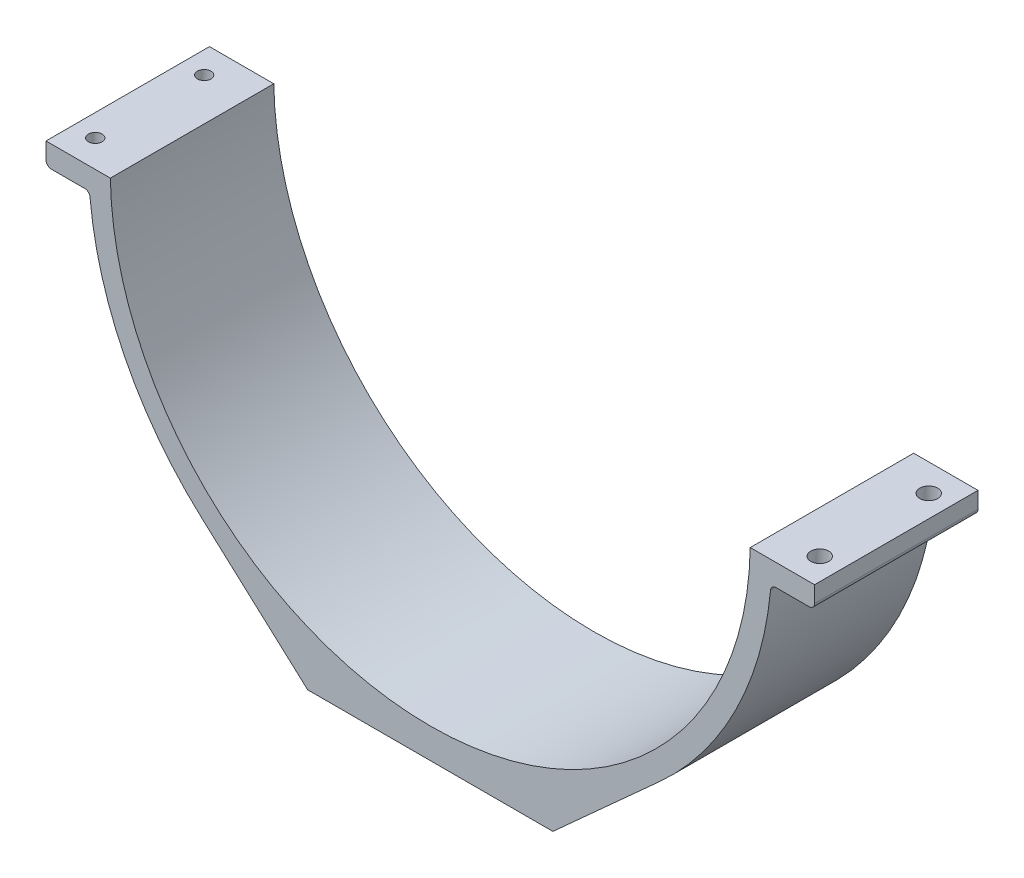
ISO-10303-21;
HEADER;
FILE_DESCRIPTION(('STEP AP214'),'2;1');
FILE_NAME('part.step','',(''),(''),'','','');
FILE_SCHEMA(('AUTOMOTIVE_DESIGN { 1 0 10303 214 1 1 1 1 }'));
ENDSEC;
DATA;
#1=APPLICATION_CONTEXT('core data for automotive mechanical design processes');
#2=APPLICATION_PROTOCOL_DEFINITION('international standard','automotive_design',2000,#1);
#3=PRODUCT_CONTEXT('',#1,'mechanical');
#4=PRODUCT('Part','Part','',(#3));
#5=PRODUCT_RELATED_PRODUCT_CATEGORY('part','',(#4));
#6=PRODUCT_DEFINITION_FORMATION('','',#4);
#7=PRODUCT_DEFINITION_CONTEXT('part definition',#1,'design');
#8=PRODUCT_DEFINITION('design','',#6,#7);
#9=PRODUCT_DEFINITION_SHAPE('','',#8);
#10=(LENGTH_UNIT() NAMED_UNIT(*) SI_UNIT(.MILLI.,.METRE.));
#11=(NAMED_UNIT(*) PLANE_ANGLE_UNIT() SI_UNIT($,.RADIAN.));
#12=(NAMED_UNIT(*) SI_UNIT($,.STERADIAN.) SOLID_ANGLE_UNIT());
#13=UNCERTAINTY_MEASURE_WITH_UNIT(LENGTH_MEASURE(1.E-05),#10,'distance_accuracy_value','');
#14=(GEOMETRIC_REPRESENTATION_CONTEXT(3) GLOBAL_UNCERTAINTY_ASSIGNED_CONTEXT((#13)) GLOBAL_UNIT_ASSIGNED_CONTEXT((#10,
#11,#12)) REPRESENTATION_CONTEXT('',''));
#15=CARTESIAN_POINT('',(0.,0.,0.));
#16=DIRECTION('',(0.,0.,1.));
#17=DIRECTION('',(1.,0.,0.));
#18=AXIS2_PLACEMENT_3D('',#15,#16,#17);
#19=CARTESIAN_POINT('',(-70.5404477118608,-1.,30.));
#20=DIRECTION('',(1.,0.,0.));
#21=DIRECTION('',(0.,1.,0.));
#22=AXIS2_PLACEMENT_3D('',#19,#20,#21);
#23=PLANE('',#22);
#24=DIRECTION('',(0.,-1.,0.));
#25=VECTOR('',#24,1.);
#26=CARTESIAN_POINT('',(-70.5404477118608,-1.,0.));
#27=LINE('',#26,#25);
#28=CARTESIAN_POINT('',(-70.5404477118608,-1.,0.));
#29=VERTEX_POINT('',#28);
#30=CARTESIAN_POINT('',(-70.5404477118608,-4.,0.));
#31=VERTEX_POINT('',#30);
#32=EDGE_CURVE('E197',#29,#31,#27,.T.);
#33=ORIENTED_EDGE('',*,*,#32,.T.);
#34=DIRECTION('',(0.,0.,-1.));
#35=VECTOR('',#34,1.);
#36=CARTESIAN_POINT('',(-70.5404477118608,-4.,30.));
#37=LINE('',#36,#35);
#38=CARTESIAN_POINT('',(-70.5404477118608,-4.,30.));
#39=VERTEX_POINT('',#38);
#40=EDGE_CURVE('E11',#39,#31,#37,.T.);
#41=ORIENTED_EDGE('',*,*,#40,.F.);
#42=DIRECTION('',(0.,-1.,0.));
#43=VECTOR('',#42,1.);
#44=CARTESIAN_POINT('',(-70.5404477118608,-1.,30.));
#45=LINE('',#44,#43);
#46=CARTESIAN_POINT('',(-70.5404477118608,-1.,30.));
#47=VERTEX_POINT('',#46);
#48=EDGE_CURVE('E243',#47,#39,#45,.T.);
#49=ORIENTED_EDGE('',*,*,#48,.F.);
#50=DIRECTION('',(0.,0.,-1.));
#51=VECTOR('',#50,1.);
#52=CARTESIAN_POINT('',(-70.5404477118608,-1.,30.));
#53=LINE('',#52,#51);
#54=EDGE_CURVE('E193',#47,#29,#53,.T.);
#55=ORIENTED_EDGE('',*,*,#54,.T.);
#56=EDGE_LOOP('',(#33,#41,#49,#55));
#57=FACE_BOUND('',#56,.T.);
#58=ADVANCED_FACE('F43',(#57),#23,.F.);
#59=CARTESIAN_POINT('',(-69.5404477118608,-4.,30.));
#60=DIRECTION('',(0.,0.,-1.));
#61=DIRECTION('',(-1.,0.,0.));
#62=AXIS2_PLACEMENT_3D('',#59,#60,#61);
#63=CYLINDRICAL_SURFACE('',#62,0.999999999999994);
#64=CARTESIAN_POINT('',(-69.5404477118608,-4.,0.));
#65=DIRECTION('',(0.,0.,1.));
#66=DIRECTION('',(1.,0.,0.));
#67=AXIS2_PLACEMENT_3D('',#64,#65,#66);
#68=CIRCLE('',#67,0.999999999999994);
#69=CARTESIAN_POINT('',(-69.5404477118608,-5.,0.));
#70=VERTEX_POINT('',#69);
#71=EDGE_CURVE('E201',#31,#70,#68,.T.);
#72=ORIENTED_EDGE('',*,*,#71,.T.);
#73=DIRECTION('',(0.,0.,-1.));
#74=VECTOR('',#73,1.);
#75=CARTESIAN_POINT('',(-69.5404477118608,-5.,30.));
#76=LINE('',#75,#74);
#77=CARTESIAN_POINT('',(-69.5404477118608,-5.,30.));
#78=VERTEX_POINT('',#77);
#79=EDGE_CURVE('E52',#78,#70,#76,.T.);
#80=ORIENTED_EDGE('',*,*,#79,.F.);
#81=CARTESIAN_POINT('',(-69.5404477118608,-4.,30.));
#82=DIRECTION('',(0.,0.,1.));
#83=DIRECTION('',(1.,0.,0.));
#84=AXIS2_PLACEMENT_3D('',#81,#82,#83);
#85=CIRCLE('',#84,0.999999999999994);
#86=EDGE_CURVE('E128',#39,#78,#85,.T.);
#87=ORIENTED_EDGE('',*,*,#86,.F.);
#88=ORIENTED_EDGE('',*,*,#40,.T.);
#89=EDGE_LOOP('',(#72,#80,#87,#88));
#90=FACE_BOUND('',#89,.T.);
#91=ADVANCED_FACE('F413',(#90),#63,.T.);
#92=CARTESIAN_POINT('',(-69.5404477118608,-5.,30.));
#93=DIRECTION('',(0.,1.,0.));
#94=DIRECTION('',(-1.,0.,0.));
#95=AXIS2_PLACEMENT_3D('',#92,#93,#94);
#96=PLANE('',#95);
#97=CARTESIAN_POINT('',(-66.4987110559215,-4.99999999999999,5.));
#98=DIRECTION('',(0.,-1.,0.));
#99=DIRECTION('',(0.,0.,-1.));
#100=AXIS2_PLACEMENT_3D('',#97,#98,#99);
#101=CIRCLE('',#100,1.24999999999999);
#102=CARTESIAN_POINT('',(-66.4987110559215,-4.99999999999999,3.75000000000001));
#103=VERTEX_POINT('',#102);
#104=EDGE_CURVE('E393',#103,#103,#101,.T.);
#105=ORIENTED_EDGE('',*,*,#104,.F.);
#106=EDGE_LOOP('',(#105));
#107=FACE_BOUND('',#106,.T.);
#108=CARTESIAN_POINT('',(-66.4987110559215,-4.99999999999999,25.));
#109=DIRECTION('',(0.,-1.,0.));
#110=DIRECTION('',(0.,0.,-1.));
#111=AXIS2_PLACEMENT_3D('',#108,#109,#110);
#112=CIRCLE('',#111,1.24999999999999);
#113=CARTESIAN_POINT('',(-66.4987110559215,-4.99999999999999,23.75));
#114=VERTEX_POINT('',#113);
#115=EDGE_CURVE('E401',#114,#114,#112,.T.);
#116=ORIENTED_EDGE('',*,*,#115,.F.);
#117=EDGE_LOOP('',(#116));
#118=FACE_BOUND('',#117,.T.);
#119=DIRECTION('',(1.,0.,0.));
#120=VECTOR('',#119,1.);
#121=CARTESIAN_POINT('',(-69.5404477118608,-5.,0.));
#122=LINE('',#121,#120);
#123=CARTESIAN_POINT('',(-63.4569743999822,-4.99999999999999,0.));
#124=VERTEX_POINT('',#123);
#125=EDGE_CURVE('E205',#70,#124,#122,.T.);
#126=ORIENTED_EDGE('',*,*,#125,.T.);
#127=DIRECTION('',(0.,0.,-1.));
#128=VECTOR('',#127,1.);
#129=CARTESIAN_POINT('',(-63.4569743999822,-4.99999999999999,30.));
#130=LINE('',#129,#128);
#131=CARTESIAN_POINT('',(-63.4569743999822,-4.99999999999999,30.));
#132=VERTEX_POINT('',#131);
#133=EDGE_CURVE('E285',#132,#124,#130,.T.);
#134=ORIENTED_EDGE('',*,*,#133,.F.);
#135=DIRECTION('',(1.,0.,0.));
#136=VECTOR('',#135,1.);
#137=CARTESIAN_POINT('',(-69.5404477118608,-5.,30.));
#138=LINE('',#137,#136);
#139=EDGE_CURVE('E295',#78,#132,#138,.T.);
#140=ORIENTED_EDGE('',*,*,#139,.F.);
#141=ORIENTED_EDGE('',*,*,#79,.T.);
#142=EDGE_LOOP('',(#126,#134,#140,#141));
#143=FACE_BOUND('',#142,.T.);
#144=ADVANCED_FACE('F293',(#107,#118,#143),#96,.F.);
#145=CARTESIAN_POINT('',(-63.4569743999822,-6.,30.));
#146=DIRECTION('',(0.,0.,-1.));
#147=DIRECTION('',(-1.,0.,0.));
#148=AXIS2_PLACEMENT_3D('',#145,#146,#147);
#149=CYLINDRICAL_SURFACE('',#148,1.00000000000001);
#150=CARTESIAN_POINT('',(-63.4569743999822,-6.,0.));
#151=DIRECTION('',(0.,0.,-1.));
#152=DIRECTION('',(1.,0.,0.));
#153=AXIS2_PLACEMENT_3D('',#150,#151,#152);
#154=CIRCLE('',#153,1.00000000000001);
#155=CARTESIAN_POINT('',(-62.4614147137572,-5.90586758707246,0.));
#156=VERTEX_POINT('',#155);
#157=EDGE_CURVE('E208',#124,#156,#154,.T.);
#158=ORIENTED_EDGE('',*,*,#157,.T.);
#159=DIRECTION('',(0.,0.,-1.));
#160=VECTOR('',#159,1.);
#161=CARTESIAN_POINT('',(-62.4614147137572,-5.90586758707246,30.));
#162=LINE('',#161,#160);
#163=CARTESIAN_POINT('',(-62.4614147137572,-5.90586758707246,30.));
#164=VERTEX_POINT('',#163);
#165=EDGE_CURVE('E281',#164,#156,#162,.T.);
#166=ORIENTED_EDGE('',*,*,#165,.F.);
#167=CARTESIAN_POINT('',(-63.4569743999822,-6.,30.));
#168=DIRECTION('',(0.,0.,-1.));
#169=DIRECTION('',(1.,0.,0.));
#170=AXIS2_PLACEMENT_3D('',#167,#168,#169);
#171=CIRCLE('',#170,1.00000000000001);
#172=EDGE_CURVE('E314',#132,#164,#171,.T.);
#173=ORIENTED_EDGE('',*,*,#172,.F.);
#174=ORIENTED_EDGE('',*,*,#133,.T.);
#175=EDGE_LOOP('',(#158,#166,#173,#174));
#176=FACE_BOUND('',#175,.T.);
#177=ADVANCED_FACE('F304',(#176),#149,.F.);
#178=CARTESIAN_POINT('',(0.,0.,30.));
#179=DIRECTION('',(0.,0.,-1.));
#180=DIRECTION('',(-1.,0.,0.));
#181=AXIS2_PLACEMENT_3D('',#178,#179,#180);
#182=CYLINDRICAL_SURFACE('',#181,62.74);
#183=CARTESIAN_POINT('',(0.,0.,0.));
#184=DIRECTION('',(0.,0.,1.));
#185=DIRECTION('',(1.,0.,0.));
#186=AXIS2_PLACEMENT_3D('',#183,#184,#185);
#187=CIRCLE('',#186,62.74);
#188=CARTESIAN_POINT('',(-42.0786666547349,-46.5370112121491,0.));
#189=VERTEX_POINT('',#188);
#190=EDGE_CURVE('E211',#156,#189,#187,.T.);
#191=ORIENTED_EDGE('',*,*,#190,.T.);
#192=DIRECTION('',(0.,0.,-1.));
#193=VECTOR('',#192,1.);
#194=CARTESIAN_POINT('',(-42.0786666547349,-46.5370112121491,30.));
#195=LINE('',#194,#193);
#196=CARTESIAN_POINT('',(-42.0786666547349,-46.5370112121491,30.));
#197=VERTEX_POINT('',#196);
#198=EDGE_CURVE('E277',#197,#189,#195,.T.);
#199=ORIENTED_EDGE('',*,*,#198,.F.);
#200=CARTESIAN_POINT('',(0.,0.,30.));
#201=DIRECTION('',(0.,0.,1.));
#202=DIRECTION('',(1.,0.,0.));
#203=AXIS2_PLACEMENT_3D('',#200,#201,#202);
#204=CIRCLE('',#203,62.74);
#205=EDGE_CURVE('E310',#164,#197,#204,.T.);
#206=ORIENTED_EDGE('',*,*,#205,.F.);
#207=ORIENTED_EDGE('',*,*,#165,.T.);
#208=EDGE_LOOP('',(#191,#199,#206,#207));
#209=FACE_BOUND('',#208,.T.);
#210=ADVANCED_FACE('F308',(#209),#182,.T.);
#211=CARTESIAN_POINT('',(-22.5,-64.24,30.));
#212=DIRECTION('',(0.670683242823318,0.741743882884112,0.));
#213=DIRECTION('',(-0.741743882884112,0.670683242823318,0.));
#214=AXIS2_PLACEMENT_3D('',#211,#212,#213);
#215=PLANE('',#214);
#216=DIRECTION('',(0.741743882884112,-0.670683242823318,0.));
#217=VECTOR('',#216,1.);
#218=CARTESIAN_POINT('',(-22.5,-64.24,0.));
#219=LINE('',#218,#217);
#220=CARTESIAN_POINT('',(-22.5,-64.24,0.));
#221=VERTEX_POINT('',#220);
#222=EDGE_CURVE('E214',#189,#221,#219,.T.);
#223=ORIENTED_EDGE('',*,*,#222,.T.);
#224=DIRECTION('',(0.,0.,-1.));
#225=VECTOR('',#224,1.);
#226=CARTESIAN_POINT('',(-22.5,-64.24,30.));
#227=LINE('',#226,#225);
#228=CARTESIAN_POINT('',(-22.5,-64.24,30.));
#229=VERTEX_POINT('',#228);
#230=EDGE_CURVE('E273',#229,#221,#227,.T.);
#231=ORIENTED_EDGE('',*,*,#230,.F.);
#232=DIRECTION('',(0.741743882884112,-0.670683242823318,0.));
#233=VECTOR('',#232,1.);
#234=CARTESIAN_POINT('',(-22.5,-64.24,30.));
#235=LINE('',#234,#233);
#236=EDGE_CURVE('E313',#197,#229,#235,.T.);
#237=ORIENTED_EDGE('',*,*,#236,.F.);
#238=ORIENTED_EDGE('',*,*,#198,.T.);
#239=EDGE_LOOP('',(#223,#231,#237,#238));
#240=FACE_BOUND('',#239,.T.);
#241=ADVANCED_FACE('F426',(#240),#215,.F.);
#242=CARTESIAN_POINT('',(-22.5,-64.24,30.));
#243=DIRECTION('',(0.,1.,0.));
#244=DIRECTION('',(0.,0.,1.));
#245=AXIS2_PLACEMENT_3D('',#242,#243,#244);
#246=PLANE('',#245);
#247=CARTESIAN_POINT('',(-20.,-64.24,5.));
#248=DIRECTION('',(0.,-1.,0.));
#249=DIRECTION('',(0.,0.,-1.));
#250=AXIS2_PLACEMENT_3D('',#247,#248,#249);
#251=CIRCLE('',#250,1.65);
#252=CARTESIAN_POINT('',(-20.,-64.24,3.35));
#253=VERTEX_POINT('',#252);
#254=EDGE_CURVE('E348',#253,#253,#251,.T.);
#255=ORIENTED_EDGE('',*,*,#254,.F.);
#256=EDGE_LOOP('',(#255));
#257=FACE_BOUND('',#256,.T.);
#258=CARTESIAN_POINT('',(20.,-64.24,5.));
#259=DIRECTION('',(0.,-1.,0.));
#260=DIRECTION('',(0.,0.,-1.));
#261=AXIS2_PLACEMENT_3D('',#258,#259,#260);
#262=CIRCLE('',#261,1.65);
#263=CARTESIAN_POINT('',(20.,-64.24,3.35));
#264=VERTEX_POINT('',#263);
#265=EDGE_CURVE('E347',#264,#264,#262,.T.);
#266=ORIENTED_EDGE('',*,*,#265,.F.);
#267=EDGE_LOOP('',(#266));
#268=FACE_BOUND('',#267,.T.);
#269=CARTESIAN_POINT('',(-20.0000000000051,-64.24,25.));
#270=DIRECTION('',(0.,-1.,0.));
#271=DIRECTION('',(0.,0.,-1.));
#272=AXIS2_PLACEMENT_3D('',#269,#270,#271);
#273=CIRCLE('',#272,1.65);
#274=CARTESIAN_POINT('',(-20.0000000000051,-64.24,23.35));
#275=VERTEX_POINT('',#274);
#276=EDGE_CURVE('E353',#275,#275,#273,.T.);
#277=ORIENTED_EDGE('',*,*,#276,.F.);
#278=EDGE_LOOP('',(#277));
#279=FACE_BOUND('',#278,.T.);
#280=CARTESIAN_POINT('',(20.0000000000051,-64.24,25.));
#281=DIRECTION('',(0.,-1.,0.));
#282=DIRECTION('',(0.,0.,-1.));
#283=AXIS2_PLACEMENT_3D('',#280,#281,#282);
#284=CIRCLE('',#283,1.65);
#285=CARTESIAN_POINT('',(20.0000000000051,-64.24,23.35));
#286=VERTEX_POINT('',#285);
#287=EDGE_CURVE('E352',#286,#286,#284,.T.);
#288=ORIENTED_EDGE('',*,*,#287,.F.);
#289=EDGE_LOOP('',(#288));
#290=FACE_BOUND('',#289,.T.);
#291=DIRECTION('',(1.,0.,0.));
#292=VECTOR('',#291,1.);
#293=CARTESIAN_POINT('',(-22.5,-64.24,0.));
#294=LINE('',#293,#292);
#295=CARTESIAN_POINT('',(22.5,-64.24,0.));
#296=VERTEX_POINT('',#295);
#297=EDGE_CURVE('E217',#221,#296,#294,.T.);
#298=ORIENTED_EDGE('',*,*,#297,.T.);
#299=DIRECTION('',(0.,0.,-1.));
#300=VECTOR('',#299,1.);
#301=CARTESIAN_POINT('',(22.5,-64.24,30.));
#302=LINE('',#301,#300);
#303=CARTESIAN_POINT('',(22.5,-64.24,30.));
#304=VERTEX_POINT('',#303);
#305=EDGE_CURVE('E269',#304,#296,#302,.T.);
#306=ORIENTED_EDGE('',*,*,#305,.F.);
#307=DIRECTION('',(1.,0.,0.));
#308=VECTOR('',#307,1.);
#309=CARTESIAN_POINT('',(-22.5,-64.24,30.));
#310=LINE('',#309,#308);
#311=EDGE_CURVE('E318',#229,#304,#310,.T.);
#312=ORIENTED_EDGE('',*,*,#311,.F.);
#313=ORIENTED_EDGE('',*,*,#230,.T.);
#314=EDGE_LOOP('',(#298,#306,#312,#313));
#315=FACE_BOUND('',#314,.T.);
#316=ADVANCED_FACE('F429',(#257,#268,#279,#290,#315),#246,.F.);
#317=CARTESIAN_POINT('',(22.5,-64.24,30.));
#318=DIRECTION('',(-0.670683242823318,0.741743882884111,0.));
#319=DIRECTION('',(-0.741743882884111,-0.670683242823318,0.));
#320=AXIS2_PLACEMENT_3D('',#317,#318,#319);
#321=PLANE('',#320);
#322=DIRECTION('',(0.741743882884111,0.670683242823318,0.));
#323=VECTOR('',#322,1.);
#324=CARTESIAN_POINT('',(22.5,-64.24,0.));
#325=LINE('',#324,#323);
#326=CARTESIAN_POINT('',(42.078666654735,-46.5370112121491,0.));
#327=VERTEX_POINT('',#326);
#328=EDGE_CURVE('E220',#296,#327,#325,.T.);
#329=ORIENTED_EDGE('',*,*,#328,.T.);
#330=DIRECTION('',(0.,0.,-1.));
#331=VECTOR('',#330,1.);
#332=CARTESIAN_POINT('',(42.078666654735,-46.5370112121491,30.));
#333=LINE('',#332,#331);
#334=CARTESIAN_POINT('',(42.078666654735,-46.5370112121491,30.));
#335=VERTEX_POINT('',#334);
#336=EDGE_CURVE('E265',#335,#327,#333,.T.);
#337=ORIENTED_EDGE('',*,*,#336,.F.);
#338=DIRECTION('',(0.741743882884111,0.670683242823318,0.));
#339=VECTOR('',#338,1.);
#340=CARTESIAN_POINT('',(22.5,-64.24,30.));
#341=LINE('',#340,#339);
#342=EDGE_CURVE('E326',#304,#335,#341,.T.);
#343=ORIENTED_EDGE('',*,*,#342,.F.);
#344=ORIENTED_EDGE('',*,*,#305,.T.);
#345=EDGE_LOOP('',(#329,#337,#343,#344));
#346=FACE_BOUND('',#345,.T.);
#347=ADVANCED_FACE('F433',(#346),#321,.F.);
#348=CARTESIAN_POINT('',(0.,0.,30.));
#349=DIRECTION('',(0.,0.,-1.));
#350=DIRECTION('',(-1.,0.,0.));
#351=AXIS2_PLACEMENT_3D('',#348,#349,#350);
#352=CYLINDRICAL_SURFACE('',#351,62.74);
#353=CARTESIAN_POINT('',(0.,0.,0.));
#354=DIRECTION('',(0.,0.,1.));
#355=DIRECTION('',(-1.,0.,0.));
#356=AXIS2_PLACEMENT_3D('',#353,#354,#355);
#357=CIRCLE('',#356,62.74);
#358=CARTESIAN_POINT('',(62.4614147137572,-5.90586758707248,0.));
#359=VERTEX_POINT('',#358);
#360=EDGE_CURVE('E223',#327,#359,#357,.T.);
#361=ORIENTED_EDGE('',*,*,#360,.T.);
#362=DIRECTION('',(0.,0.,-1.));
#363=VECTOR('',#362,1.);
#364=CARTESIAN_POINT('',(62.4614147137572,-5.90586758707248,30.));
#365=LINE('',#364,#363);
#366=CARTESIAN_POINT('',(62.4614147137572,-5.90586758707248,30.));
#367=VERTEX_POINT('',#366);
#368=EDGE_CURVE('E261',#367,#359,#365,.T.);
#369=ORIENTED_EDGE('',*,*,#368,.F.);
#370=CARTESIAN_POINT('',(0.,0.,30.));
#371=DIRECTION('',(0.,0.,1.));
#372=DIRECTION('',(-1.,0.,0.));
#373=AXIS2_PLACEMENT_3D('',#370,#371,#372);
#374=CIRCLE('',#373,62.74);
#375=EDGE_CURVE('E329',#335,#367,#374,.T.);
#376=ORIENTED_EDGE('',*,*,#375,.F.);
#377=ORIENTED_EDGE('',*,*,#336,.T.);
#378=EDGE_LOOP('',(#361,#369,#376,#377));
#379=FACE_BOUND('',#378,.T.);
#380=ADVANCED_FACE('F437',(#379),#352,.T.);
#381=CARTESIAN_POINT('',(63.4569743999822,-6.,30.));
#382=DIRECTION('',(0.,0.,-1.));
#383=DIRECTION('',(-1.,0.,0.));
#384=AXIS2_PLACEMENT_3D('',#381,#382,#383);
#385=CYLINDRICAL_SURFACE('',#384,1.00000000000001);
#386=CARTESIAN_POINT('',(63.4569743999822,-6.,0.));
#387=DIRECTION('',(0.,0.,-1.));
#388=DIRECTION('',(-1.,0.,0.));
#389=AXIS2_PLACEMENT_3D('',#386,#387,#388);
#390=CIRCLE('',#389,1.00000000000001);
#391=CARTESIAN_POINT('',(63.4569743999822,-5.,0.));
#392=VERTEX_POINT('',#391);
#393=EDGE_CURVE('E226',#359,#392,#390,.T.);
#394=ORIENTED_EDGE('',*,*,#393,.T.);
#395=DIRECTION('',(0.,0.,-1.));
#396=VECTOR('',#395,1.);
#397=CARTESIAN_POINT('',(63.4569743999822,-5.,30.));
#398=LINE('',#397,#396);
#399=CARTESIAN_POINT('',(63.4569743999822,-5.,30.));
#400=VERTEX_POINT('',#399);
#401=EDGE_CURVE('E257',#400,#392,#398,.T.);
#402=ORIENTED_EDGE('',*,*,#401,.F.);
#403=CARTESIAN_POINT('',(63.4569743999822,-6.,30.));
#404=DIRECTION('',(0.,0.,-1.));
#405=DIRECTION('',(-1.,0.,0.));
#406=AXIS2_PLACEMENT_3D('',#403,#404,#405);
#407=CIRCLE('',#406,1.00000000000001);
#408=EDGE_CURVE('E332',#367,#400,#407,.T.);
#409=ORIENTED_EDGE('',*,*,#408,.F.);
#410=ORIENTED_EDGE('',*,*,#368,.T.);
#411=EDGE_LOOP('',(#394,#402,#409,#410));
#412=FACE_BOUND('',#411,.T.);
#413=ADVANCED_FACE('F441',(#412),#385,.F.);
#414=CARTESIAN_POINT('',(69.5404477118608,-4.99999999999998,30.));
#415=DIRECTION('',(0.,1.,0.));
#416=DIRECTION('',(-1.,0.,0.));
#417=AXIS2_PLACEMENT_3D('',#414,#415,#416);
#418=PLANE('',#417);
#419=CARTESIAN_POINT('',(66.4987110559139,-5.00000000000016,5.00000000001225));
#420=DIRECTION('',(0.,-1.,0.));
#421=DIRECTION('',(0.,0.,-1.));
#422=AXIS2_PLACEMENT_3D('',#419,#420,#421);
#423=CIRCLE('',#422,1.65);
#424=CARTESIAN_POINT('',(66.4987110559139,-5.00000000000016,3.35000000001225));
#425=VERTEX_POINT('',#424);
#426=EDGE_CURVE('E364',#425,#425,#423,.T.);
#427=ORIENTED_EDGE('',*,*,#426,.F.);
#428=EDGE_LOOP('',(#427));
#429=FACE_BOUND('',#428,.T.);
#430=CARTESIAN_POINT('',(66.4987110559139,-5.00000000000016,25.0000000000122));
#431=DIRECTION('',(0.,-1.,0.));
#432=DIRECTION('',(0.,0.,-1.));
#433=AXIS2_PLACEMENT_3D('',#430,#431,#432);
#434=CIRCLE('',#433,1.65);
#435=CARTESIAN_POINT('',(66.4987110559139,-5.00000000000016,23.3500000000122));
#436=VERTEX_POINT('',#435);
#437=EDGE_CURVE('E360',#436,#436,#434,.T.);
#438=ORIENTED_EDGE('',*,*,#437,.F.);
#439=EDGE_LOOP('',(#438));
#440=FACE_BOUND('',#439,.T.);
#441=DIRECTION('',(1.,0.,0.));
#442=VECTOR('',#441,1.);
#443=CARTESIAN_POINT('',(69.5404477118608,-4.99999999999998,0.));
#444=LINE('',#443,#442);
#445=CARTESIAN_POINT('',(69.5404477118608,-4.99999999999998,0.));
#446=VERTEX_POINT('',#445);
#447=EDGE_CURVE('E229',#392,#446,#444,.T.);
#448=ORIENTED_EDGE('',*,*,#447,.T.);
#449=DIRECTION('',(0.,0.,-1.));
#450=VECTOR('',#449,1.);
#451=CARTESIAN_POINT('',(69.5404477118608,-4.99999999999998,30.));
#452=LINE('',#451,#450);
#453=CARTESIAN_POINT('',(69.5404477118608,-4.99999999999998,30.));
#454=VERTEX_POINT('',#453);
#455=EDGE_CURVE('E253',#454,#446,#452,.T.);
#456=ORIENTED_EDGE('',*,*,#455,.F.);
#457=DIRECTION('',(1.,0.,0.));
#458=VECTOR('',#457,1.);
#459=CARTESIAN_POINT('',(69.5404477118608,-4.99999999999998,30.));
#460=LINE('',#459,#458);
#461=EDGE_CURVE('E335',#400,#454,#460,.T.);
#462=ORIENTED_EDGE('',*,*,#461,.F.);
#463=ORIENTED_EDGE('',*,*,#401,.T.);
#464=EDGE_LOOP('',(#448,#456,#462,#463));
#465=FACE_BOUND('',#464,.T.);
#466=ADVANCED_FACE('F445',(#429,#440,#465),#418,.F.);
#467=CARTESIAN_POINT('',(69.5404477118608,-3.99999999999998,30.));
#468=DIRECTION('',(0.,0.,-1.));
#469=DIRECTION('',(-1.,0.,0.));
#470=AXIS2_PLACEMENT_3D('',#467,#468,#469);
#471=CYLINDRICAL_SURFACE('',#470,0.999999999999994);
#472=CARTESIAN_POINT('',(69.5404477118608,-3.99999999999998,0.));
#473=DIRECTION('',(0.,0.,1.));
#474=DIRECTION('',(-1.,0.,0.));
#475=AXIS2_PLACEMENT_3D('',#472,#473,#474);
#476=CIRCLE('',#475,0.999999999999994);
#477=CARTESIAN_POINT('',(70.5404477118608,-3.99999999999998,0.));
#478=VERTEX_POINT('',#477);
#479=EDGE_CURVE('E232',#446,#478,#476,.T.);
#480=ORIENTED_EDGE('',*,*,#479,.T.);
#481=DIRECTION('',(0.,0.,-1.));
#482=VECTOR('',#481,1.);
#483=CARTESIAN_POINT('',(70.5404477118608,-3.99999999999998,30.));
#484=LINE('',#483,#482);
#485=CARTESIAN_POINT('',(70.5404477118608,-3.99999999999998,30.));
#486=VERTEX_POINT('',#485);
#487=EDGE_CURVE('E249',#486,#478,#484,.T.);
#488=ORIENTED_EDGE('',*,*,#487,.F.);
#489=CARTESIAN_POINT('',(69.5404477118608,-3.99999999999998,30.));
#490=DIRECTION('',(0.,0.,1.));
#491=DIRECTION('',(-1.,0.,0.));
#492=AXIS2_PLACEMENT_3D('',#489,#490,#491);
#493=CIRCLE('',#492,0.999999999999994);
#494=EDGE_CURVE('E338',#454,#486,#493,.T.);
#495=ORIENTED_EDGE('',*,*,#494,.F.);
#496=ORIENTED_EDGE('',*,*,#455,.T.);
#497=EDGE_LOOP('',(#480,#488,#495,#496));
#498=FACE_BOUND('',#497,.T.);
#499=ADVANCED_FACE('F449',(#498),#471,.T.);
#500=CARTESIAN_POINT('',(70.5404477118608,-0.999999999999983,30.));
#501=DIRECTION('',(-1.,0.,0.));
#502=DIRECTION('',(0.,-1.,0.));
#503=AXIS2_PLACEMENT_3D('',#500,#501,#502);
#504=PLANE('',#503);
#505=DIRECTION('',(0.,1.,0.));
#506=VECTOR('',#505,1.);
#507=CARTESIAN_POINT('',(70.5404477118608,-0.999999999999983,0.));
#508=LINE('',#507,#506);
#509=CARTESIAN_POINT('',(70.5404477118608,-0.999999999999983,0.));
#510=VERTEX_POINT('',#509);
#511=EDGE_CURVE('E235',#478,#510,#508,.T.);
#512=ORIENTED_EDGE('',*,*,#511,.T.);
#513=DIRECTION('',(0.,0.,-1.));
#514=VECTOR('',#513,1.);
#515=CARTESIAN_POINT('',(70.5404477118608,-0.999999999999983,30.));
#516=LINE('',#515,#514);
#517=CARTESIAN_POINT('',(70.5404477118608,-0.999999999999983,30.));
#518=VERTEX_POINT('',#517);
#519=EDGE_CURVE('E184',#518,#510,#516,.T.);
#520=ORIENTED_EDGE('',*,*,#519,.F.);
#521=DIRECTION('',(0.,1.,0.));
#522=VECTOR('',#521,1.);
#523=CARTESIAN_POINT('',(70.5404477118608,-0.999999999999983,30.));
#524=LINE('',#523,#522);
#525=EDGE_CURVE('E173',#486,#518,#524,.T.);
#526=ORIENTED_EDGE('',*,*,#525,.F.);
#527=ORIENTED_EDGE('',*,*,#487,.T.);
#528=EDGE_LOOP('',(#512,#520,#526,#527));
#529=FACE_BOUND('',#528,.T.);
#530=ADVANCED_FACE('F453',(#529),#504,.F.);
#531=CARTESIAN_POINT('',(70.5404477118608,-0.999999999999983,30.));
#532=DIRECTION('',(0.,-1.,0.));
#533=DIRECTION('',(1.,0.,0.));
#534=AXIS2_PLACEMENT_3D('',#531,#532,#533);
#535=PLANE('',#534);
#536=CARTESIAN_POINT('',(66.4987110559139,-0.999999999999983,5.00000000001225));
#537=DIRECTION('',(0.,-1.,0.));
#538=DIRECTION('',(0.,0.,-1.));
#539=AXIS2_PLACEMENT_3D('',#536,#537,#538);
#540=CIRCLE('',#539,1.65);
#541=CARTESIAN_POINT('',(66.4987110559139,-0.999999999999983,3.35000000001225));
#542=VERTEX_POINT('',#541);
#543=EDGE_CURVE('E362',#542,#542,#540,.T.);
#544=ORIENTED_EDGE('',*,*,#543,.T.);
#545=EDGE_LOOP('',(#544));
#546=FACE_BOUND('',#545,.T.);
#547=CARTESIAN_POINT('',(66.4987110559139,-0.999999999999983,25.0000000000122));
#548=DIRECTION('',(0.,-1.,0.));
#549=DIRECTION('',(0.,0.,-1.));
#550=AXIS2_PLACEMENT_3D('',#547,#548,#549);
#551=CIRCLE('',#550,1.65);
#552=CARTESIAN_POINT('',(66.4987110559139,-0.999999999999983,23.3500000000122));
#553=VERTEX_POINT('',#552);
#554=EDGE_CURVE('E357',#553,#553,#551,.T.);
#555=ORIENTED_EDGE('',*,*,#554,.T.);
#556=EDGE_LOOP('',(#555));
#557=FACE_BOUND('',#556,.T.);
#558=DIRECTION('',(-1.,0.,0.));
#559=VECTOR('',#558,1.);
#560=CARTESIAN_POINT('',(70.5404477118608,-0.999999999999983,0.));
#561=LINE('',#560,#559);
#562=CARTESIAN_POINT('',(58.7314872959982,-0.999999999999991,0.));
#563=VERTEX_POINT('',#562);
#564=EDGE_CURVE('E182',#510,#563,#561,.T.);
#565=ORIENTED_EDGE('',*,*,#564,.T.);
#566=DIRECTION('',(0.,0.,-1.));
#567=VECTOR('',#566,1.);
#568=CARTESIAN_POINT('',(58.7314872959982,-0.999999999999991,30.));
#569=LINE('',#568,#567);
#570=CARTESIAN_POINT('',(58.7314872959982,-0.999999999999991,30.));
#571=VERTEX_POINT('',#570);
#572=EDGE_CURVE('E179',#571,#563,#569,.T.);
#573=ORIENTED_EDGE('',*,*,#572,.F.);
#574=DIRECTION('',(-1.,0.,0.));
#575=VECTOR('',#574,1.);
#576=CARTESIAN_POINT('',(70.5404477118608,-0.999999999999983,30.));
#577=LINE('',#576,#575);
#578=EDGE_CURVE('E167',#518,#571,#577,.T.);
#579=ORIENTED_EDGE('',*,*,#578,.F.);
#580=ORIENTED_EDGE('',*,*,#519,.T.);
#581=EDGE_LOOP('',(#565,#573,#579,#580));
#582=FACE_BOUND('',#581,.T.);
#583=ADVANCED_FACE('F180',(#546,#557,#582),#535,.F.);
#584=CARTESIAN_POINT('',(0.,0.,30.));
#585=DIRECTION('',(0.,0.,-1.));
#586=DIRECTION('',(-1.,0.,0.));
#587=AXIS2_PLACEMENT_3D('',#584,#585,#586);
#588=CYLINDRICAL_SURFACE('',#587,58.74);
#589=CARTESIAN_POINT('',(0.,0.,0.));
#590=DIRECTION('',(0.,0.,-1.));
#591=DIRECTION('',(1.,0.,0.));
#592=AXIS2_PLACEMENT_3D('',#589,#590,#591);
#593=CIRCLE('',#592,58.74);
#594=CARTESIAN_POINT('',(-58.7314872959982,-1.,0.));
#595=VERTEX_POINT('',#594);
#596=EDGE_CURVE('E114',#563,#595,#593,.T.);
#597=ORIENTED_EDGE('',*,*,#596,.T.);
#598=DIRECTION('',(0.,0.,-1.));
#599=VECTOR('',#598,1.);
#600=CARTESIAN_POINT('',(-58.7314872959982,-1.,30.));
#601=LINE('',#600,#599);
#602=CARTESIAN_POINT('',(-58.7314872959982,-1.,30.));
#603=VERTEX_POINT('',#602);
#604=EDGE_CURVE('E185',#603,#595,#601,.T.);
#605=ORIENTED_EDGE('',*,*,#604,.F.);
#606=CARTESIAN_POINT('',(0.,0.,30.));
#607=DIRECTION('',(0.,0.,-1.));
#608=DIRECTION('',(1.,0.,0.));
#609=AXIS2_PLACEMENT_3D('',#606,#607,#608);
#610=CIRCLE('',#609,58.74);
#611=EDGE_CURVE('E171',#571,#603,#610,.T.);
#612=ORIENTED_EDGE('',*,*,#611,.F.);
#613=ORIENTED_EDGE('',*,*,#572,.T.);
#614=EDGE_LOOP('',(#597,#605,#612,#613));
#615=FACE_BOUND('',#614,.T.);
#616=ADVANCED_FACE('F187',(#615),#588,.F.);
#617=CARTESIAN_POINT('',(-70.5404477118608,-1.,30.));
#618=DIRECTION('',(0.,-1.,0.));
#619=DIRECTION('',(0.,0.,-1.));
#620=AXIS2_PLACEMENT_3D('',#617,#618,#619);
#621=PLANE('',#620);
#622=CARTESIAN_POINT('',(-66.4987110559215,-0.99999999999999,5.));
#623=DIRECTION('',(0.,-1.,0.));
#624=DIRECTION('',(0.,0.,-1.));
#625=AXIS2_PLACEMENT_3D('',#622,#623,#624);
#626=CIRCLE('',#625,1.25);
#627=CARTESIAN_POINT('',(-66.4987110559215,-0.99999999999999,3.75));
#628=VERTEX_POINT('',#627);
#629=EDGE_CURVE('E397',#628,#628,#626,.T.);
#630=ORIENTED_EDGE('',*,*,#629,.T.);
#631=EDGE_LOOP('',(#630));
#632=FACE_BOUND('',#631,.T.);
#633=CARTESIAN_POINT('',(-66.4987110559215,-0.99999999999999,25.));
#634=DIRECTION('',(0.,-1.,0.));
#635=DIRECTION('',(0.,0.,-1.));
#636=AXIS2_PLACEMENT_3D('',#633,#634,#635);
#637=CIRCLE('',#636,1.25);
#638=CARTESIAN_POINT('',(-66.4987110559215,-0.99999999999999,23.75));
#639=VERTEX_POINT('',#638);
#640=EDGE_CURVE('E202',#639,#639,#637,.T.);
#641=ORIENTED_EDGE('',*,*,#640,.T.);
#642=EDGE_LOOP('',(#641));
#643=FACE_BOUND('',#642,.T.);
#644=DIRECTION('',(-1.,0.,0.));
#645=VECTOR('',#644,1.);
#646=CARTESIAN_POINT('',(-70.5404477118608,-1.,0.));
#647=LINE('',#646,#645);
#648=EDGE_CURVE('E120',#595,#29,#647,.T.);
#649=ORIENTED_EDGE('',*,*,#648,.T.);
#650=ORIENTED_EDGE('',*,*,#54,.F.);
#651=DIRECTION('',(-1.,0.,0.));
#652=VECTOR('',#651,1.);
#653=CARTESIAN_POINT('',(-70.5404477118608,-1.,30.));
#654=LINE('',#653,#652);
#655=EDGE_CURVE('E60',#603,#47,#654,.T.);
#656=ORIENTED_EDGE('',*,*,#655,.F.);
#657=ORIENTED_EDGE('',*,*,#604,.T.);
#658=EDGE_LOOP('',(#649,#650,#656,#657));
#659=FACE_BOUND('',#658,.T.);
#660=ADVANCED_FACE('F463',(#632,#643,#659),#621,.F.);
#661=CARTESIAN_POINT('',(-69.5404477118608,-4.,30.));
#662=DIRECTION('',(0.,0.,1.));
#663=DIRECTION('',(1.,0.,0.));
#664=AXIS2_PLACEMENT_3D('',#661,#662,#663);
#665=PLANE('',#664);
#666=ORIENTED_EDGE('',*,*,#48,.T.);
#667=ORIENTED_EDGE('',*,*,#86,.T.);
#668=ORIENTED_EDGE('',*,*,#139,.T.);
#669=ORIENTED_EDGE('',*,*,#172,.T.);
#670=ORIENTED_EDGE('',*,*,#205,.T.);
#671=ORIENTED_EDGE('',*,*,#236,.T.);
#672=ORIENTED_EDGE('',*,*,#311,.T.);
#673=ORIENTED_EDGE('',*,*,#342,.T.);
#674=ORIENTED_EDGE('',*,*,#375,.T.);
#675=ORIENTED_EDGE('',*,*,#408,.T.);
#676=ORIENTED_EDGE('',*,*,#461,.T.);
#677=ORIENTED_EDGE('',*,*,#494,.T.);
#678=ORIENTED_EDGE('',*,*,#525,.T.);
#679=ORIENTED_EDGE('',*,*,#578,.T.);
#680=ORIENTED_EDGE('',*,*,#611,.T.);
#681=ORIENTED_EDGE('',*,*,#655,.T.);
#682=EDGE_LOOP('',(#666,#667,#668,#669,#670,#671,#672,#673,#674,#675,#676,#677,#678,#679,#680,#681));
#683=FACE_BOUND('',#682,.T.);
#684=ADVANCED_FACE('F169',(#683),#665,.T.);
#685=CARTESIAN_POINT('',(-69.5404477118608,-4.,0.));
#686=DIRECTION('',(0.,0.,1.));
#687=DIRECTION('',(1.,0.,0.));
#688=AXIS2_PLACEMENT_3D('',#685,#686,#687);
#689=PLANE('',#688);
#690=ORIENTED_EDGE('',*,*,#32,.F.);
#691=ORIENTED_EDGE('',*,*,#648,.F.);
#692=ORIENTED_EDGE('',*,*,#596,.F.);
#693=ORIENTED_EDGE('',*,*,#564,.F.);
#694=ORIENTED_EDGE('',*,*,#511,.F.);
#695=ORIENTED_EDGE('',*,*,#479,.F.);
#696=ORIENTED_EDGE('',*,*,#447,.F.);
#697=ORIENTED_EDGE('',*,*,#393,.F.);
#698=ORIENTED_EDGE('',*,*,#360,.F.);
#699=ORIENTED_EDGE('',*,*,#328,.F.);
#700=ORIENTED_EDGE('',*,*,#297,.F.);
#701=ORIENTED_EDGE('',*,*,#222,.F.);
#702=ORIENTED_EDGE('',*,*,#190,.F.);
#703=ORIENTED_EDGE('',*,*,#157,.F.);
#704=ORIENTED_EDGE('',*,*,#125,.F.);
#705=ORIENTED_EDGE('',*,*,#71,.F.);
#706=EDGE_LOOP('',(#690,#691,#692,#693,#694,#695,#696,#697,#698,#699,#700,#701,#702,#703,#704,#705));
#707=FACE_BOUND('',#706,.T.);
#708=ADVANCED_FACE('F299',(#707),#689,.F.);
#709=CARTESIAN_POINT('',(-66.4987110559215,-4.99999999999999,25.));
#710=DIRECTION('',(0.,-1.,0.));
#711=DIRECTION('',(0.,0.,-1.));
#712=AXIS2_PLACEMENT_3D('',#709,#710,#711);
#713=CYLINDRICAL_SURFACE('',#712,1.24999999999999);
#714=ORIENTED_EDGE('',*,*,#640,.F.);
#715=EDGE_LOOP('',(#714));
#716=FACE_BOUND('',#715,.T.);
#717=ORIENTED_EDGE('',*,*,#115,.T.);
#718=EDGE_LOOP('',(#717));
#719=FACE_BOUND('',#718,.T.);
#720=ADVANCED_FACE('F469',(#716,#719),#713,.F.);
#721=CARTESIAN_POINT('',(-66.4987110559215,-4.99999999999999,5.));
#722=DIRECTION('',(0.,-1.,0.));
#723=DIRECTION('',(0.,0.,-1.));
#724=AXIS2_PLACEMENT_3D('',#721,#722,#723);
#725=CYLINDRICAL_SURFACE('',#724,1.24999999999999);
#726=ORIENTED_EDGE('',*,*,#629,.F.);
#727=EDGE_LOOP('',(#726));
#728=FACE_BOUND('',#727,.T.);
#729=ORIENTED_EDGE('',*,*,#104,.T.);
#730=EDGE_LOOP('',(#729));
#731=FACE_BOUND('',#730,.T.);
#732=ADVANCED_FACE('F474',(#728,#731),#725,.F.);
#733=CARTESIAN_POINT('',(20.0000000000051,-56.74,25.));
#734=DIRECTION('',(0.,-1.,0.));
#735=DIRECTION('',(0.,0.,-1.));
#736=AXIS2_PLACEMENT_3D('',#733,#734,#735);
#737=CONICAL_SURFACE('',#736,1.65,1.02974425867665);
#738=CARTESIAN_POINT('',(20.0000000000051,-55.7485799786045,25.));
#739=VERTEX_POINT('',#738);
#740=VERTEX_LOOP('',#739);
#741=FACE_BOUND('',#740,.T.);
#742=CARTESIAN_POINT('',(20.0000000000051,-56.74,25.));
#743=DIRECTION('',(0.,-1.,0.));
#744=DIRECTION('',(0.,0.,-1.));
#745=AXIS2_PLACEMENT_3D('',#742,#743,#744);
#746=CIRCLE('',#745,1.65);
#747=CARTESIAN_POINT('',(20.0000000000051,-56.74,23.35));
#748=VERTEX_POINT('',#747);
#749=EDGE_CURVE('E389',#748,#748,#746,.T.);
#750=ORIENTED_EDGE('',*,*,#749,.T.);
#751=EDGE_LOOP('',(#750));
#752=FACE_BOUND('',#751,.T.);
#753=ADVANCED_FACE('F478',(#741,#752),#737,.F.);
#754=CARTESIAN_POINT('',(20.0000000000051,-64.24,25.));
#755=DIRECTION('',(0.,-1.,0.));
#756=DIRECTION('',(0.,0.,-1.));
#757=AXIS2_PLACEMENT_3D('',#754,#755,#756);
#758=CYLINDRICAL_SURFACE('',#757,1.65);
#759=ORIENTED_EDGE('',*,*,#749,.F.);
#760=EDGE_LOOP('',(#759));
#761=FACE_BOUND('',#760,.T.);
#762=ORIENTED_EDGE('',*,*,#287,.T.);
#763=EDGE_LOOP('',(#762));
#764=FACE_BOUND('',#763,.T.);
#765=ADVANCED_FACE('F482',(#761,#764),#758,.F.);
#766=CARTESIAN_POINT('',(-20.0000000000051,-56.74,25.));
#767=DIRECTION('',(0.,-1.,0.));
#768=DIRECTION('',(0.,0.,-1.));
#769=AXIS2_PLACEMENT_3D('',#766,#767,#768);
#770=CONICAL_SURFACE('',#769,1.65,1.02974425867665);
#771=CARTESIAN_POINT('',(-20.0000000000051,-55.7485799786045,25.));
#772=VERTEX_POINT('',#771);
#773=VERTEX_LOOP('',#772);
#774=FACE_BOUND('',#773,.T.);
#775=CARTESIAN_POINT('',(-20.0000000000051,-56.74,25.));
#776=DIRECTION('',(0.,-1.,0.));
#777=DIRECTION('',(0.,0.,-1.));
#778=AXIS2_PLACEMENT_3D('',#775,#776,#777);
#779=CIRCLE('',#778,1.65);
#780=CARTESIAN_POINT('',(-20.0000000000051,-56.74,23.35));
#781=VERTEX_POINT('',#780);
#782=EDGE_CURVE('E350',#781,#781,#779,.T.);
#783=ORIENTED_EDGE('',*,*,#782,.T.);
#784=EDGE_LOOP('',(#783));
#785=FACE_BOUND('',#784,.T.);
#786=ADVANCED_FACE('F486',(#774,#785),#770,.F.);
#787=CARTESIAN_POINT('',(-20.0000000000051,-64.24,25.));
#788=DIRECTION('',(0.,-1.,0.));
#789=DIRECTION('',(0.,0.,-1.));
#790=AXIS2_PLACEMENT_3D('',#787,#788,#789);
#791=CYLINDRICAL_SURFACE('',#790,1.65);
#792=ORIENTED_EDGE('',*,*,#782,.F.);
#793=EDGE_LOOP('',(#792));
#794=FACE_BOUND('',#793,.T.);
#795=ORIENTED_EDGE('',*,*,#276,.T.);
#796=EDGE_LOOP('',(#795));
#797=FACE_BOUND('',#796,.T.);
#798=ADVANCED_FACE('F490',(#794,#797),#791,.F.);
#799=CARTESIAN_POINT('',(20.,-56.74,5.));
#800=DIRECTION('',(0.,-1.,0.));
#801=DIRECTION('',(0.,0.,-1.));
#802=AXIS2_PLACEMENT_3D('',#799,#800,#801);
#803=CONICAL_SURFACE('',#802,1.65,1.02974425867665);
#804=CARTESIAN_POINT('',(20.,-55.7485799786045,5.));
#805=VERTEX_POINT('',#804);
#806=VERTEX_LOOP('',#805);
#807=FACE_BOUND('',#806,.T.);
#808=CARTESIAN_POINT('',(20.,-56.74,5.));
#809=DIRECTION('',(0.,-1.,0.));
#810=DIRECTION('',(0.,0.,-1.));
#811=AXIS2_PLACEMENT_3D('',#808,#809,#810);
#812=CIRCLE('',#811,1.65);
#813=CARTESIAN_POINT('',(20.,-56.74,3.35));
#814=VERTEX_POINT('',#813);
#815=EDGE_CURVE('E379',#814,#814,#812,.T.);
#816=ORIENTED_EDGE('',*,*,#815,.T.);
#817=EDGE_LOOP('',(#816));
#818=FACE_BOUND('',#817,.T.);
#819=ADVANCED_FACE('F494',(#807,#818),#803,.F.);
#820=CARTESIAN_POINT('',(20.,-64.24,5.));
#821=DIRECTION('',(0.,-1.,0.));
#822=DIRECTION('',(0.,0.,-1.));
#823=AXIS2_PLACEMENT_3D('',#820,#821,#822);
#824=CYLINDRICAL_SURFACE('',#823,1.65);
#825=ORIENTED_EDGE('',*,*,#815,.F.);
#826=EDGE_LOOP('',(#825));
#827=FACE_BOUND('',#826,.T.);
#828=ORIENTED_EDGE('',*,*,#265,.T.);
#829=EDGE_LOOP('',(#828));
#830=FACE_BOUND('',#829,.T.);
#831=ADVANCED_FACE('F498',(#827,#830),#824,.F.);
#832=CARTESIAN_POINT('',(-20.,-56.74,5.));
#833=DIRECTION('',(0.,-1.,0.));
#834=DIRECTION('',(0.,0.,-1.));
#835=AXIS2_PLACEMENT_3D('',#832,#833,#834);
#836=CONICAL_SURFACE('',#835,1.65,1.02974425867665);
#837=CARTESIAN_POINT('',(-20.,-55.7485799786045,5.));
#838=VERTEX_POINT('',#837);
#839=VERTEX_LOOP('',#838);
#840=FACE_BOUND('',#839,.T.);
#841=CARTESIAN_POINT('',(-20.,-56.74,5.));
#842=DIRECTION('',(0.,-1.,0.));
#843=DIRECTION('',(0.,0.,-1.));
#844=AXIS2_PLACEMENT_3D('',#841,#842,#843);
#845=CIRCLE('',#844,1.65);
#846=CARTESIAN_POINT('',(-20.,-56.74,3.35));
#847=VERTEX_POINT('',#846);
#848=EDGE_CURVE('E344',#847,#847,#845,.T.);
#849=ORIENTED_EDGE('',*,*,#848,.T.);
#850=EDGE_LOOP('',(#849));
#851=FACE_BOUND('',#850,.T.);
#852=ADVANCED_FACE('F502',(#840,#851),#836,.F.);
#853=CARTESIAN_POINT('',(-20.,-64.24,5.));
#854=DIRECTION('',(0.,-1.,0.));
#855=DIRECTION('',(0.,0.,-1.));
#856=AXIS2_PLACEMENT_3D('',#853,#854,#855);
#857=CYLINDRICAL_SURFACE('',#856,1.65);
#858=ORIENTED_EDGE('',*,*,#848,.F.);
#859=EDGE_LOOP('',(#858));
#860=FACE_BOUND('',#859,.T.);
#861=ORIENTED_EDGE('',*,*,#254,.T.);
#862=EDGE_LOOP('',(#861));
#863=FACE_BOUND('',#862,.T.);
#864=ADVANCED_FACE('F506',(#860,#863),#857,.F.);
#865=CARTESIAN_POINT('',(66.4987110559139,-0.999999999999983,25.0000000000122));
#866=DIRECTION('',(0.,-1.,0.));
#867=DIRECTION('',(0.,0.,-1.));
#868=AXIS2_PLACEMENT_3D('',#865,#866,#867);
#869=CYLINDRICAL_SURFACE('',#868,1.65);
#870=ORIENTED_EDGE('',*,*,#554,.F.);
#871=EDGE_LOOP('',(#870));
#872=FACE_BOUND('',#871,.T.);
#873=ORIENTED_EDGE('',*,*,#437,.T.);
#874=EDGE_LOOP('',(#873));
#875=FACE_BOUND('',#874,.T.);
#876=ADVANCED_FACE('F510',(#872,#875),#869,.F.);
#877=CARTESIAN_POINT('',(66.4987110559139,-0.999999999999983,5.00000000001225));
#878=DIRECTION('',(0.,-1.,0.));
#879=DIRECTION('',(0.,0.,-1.));
#880=AXIS2_PLACEMENT_3D('',#877,#878,#879);
#881=CYLINDRICAL_SURFACE('',#880,1.65);
#882=ORIENTED_EDGE('',*,*,#543,.F.);
#883=EDGE_LOOP('',(#882));
#884=FACE_BOUND('',#883,.T.);
#885=ORIENTED_EDGE('',*,*,#426,.T.);
#886=EDGE_LOOP('',(#885));
#887=FACE_BOUND('',#886,.T.);
#888=ADVANCED_FACE('F514',(#884,#887),#881,.F.);
#889=CLOSED_SHELL('',(#58,#91,#144,#177,#210,#241,#316,#347,#380,#413,#466,#499,#530,#583,#616,
#660,#684,#708,#720,#732,#753,#765,#786,#798,#819,#831,#852,#864,#876,#888));
#890=MANIFOLD_SOLID_BREP('B2',#889);
#891=ADVANCED_BREP_SHAPE_REPRESENTATION('',(#18,#890),#14);
#892=SHAPE_DEFINITION_REPRESENTATION(#9,#891);
ENDSEC;
END-ISO-10303-21;
